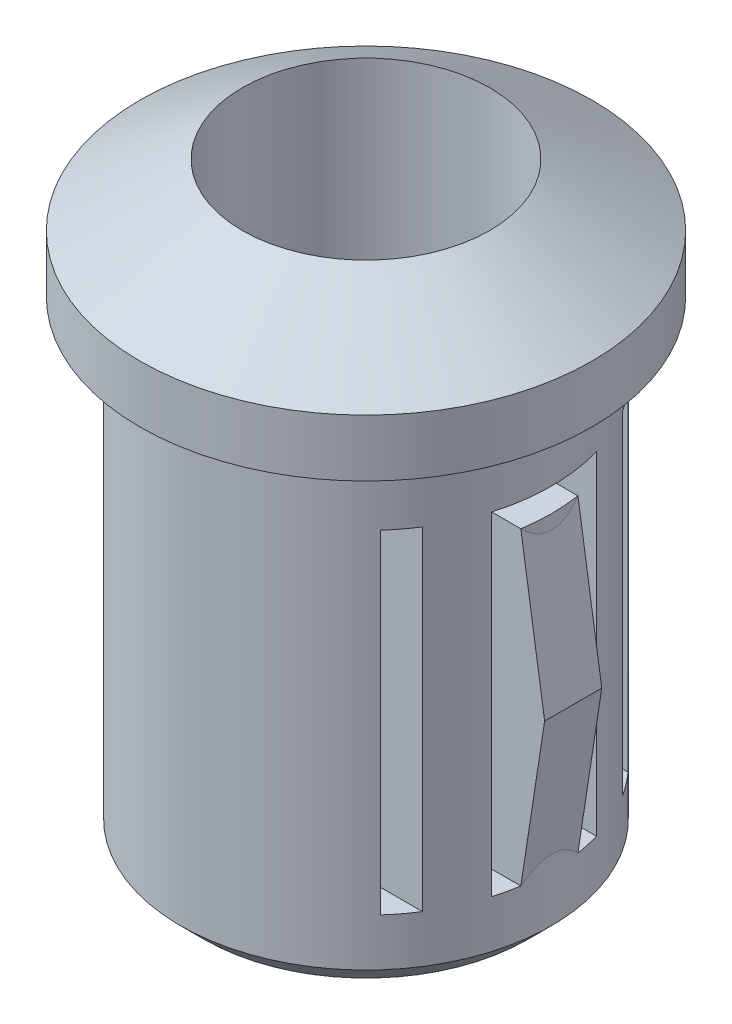
ISO-10303-21;
HEADER;
FILE_DESCRIPTION(('STEP AP214'),'2;1');
FILE_NAME('part.step','',(''),(''),'','','');
FILE_SCHEMA(('AUTOMOTIVE_DESIGN { 1 0 10303 214 1 1 1 1 }'));
ENDSEC;
DATA;
#1=APPLICATION_CONTEXT('core data for automotive mechanical design processes');
#2=APPLICATION_PROTOCOL_DEFINITION('international standard','automotive_design',2000,#1);
#3=PRODUCT_CONTEXT('',#1,'mechanical');
#4=PRODUCT('Part','Part','',(#3));
#5=PRODUCT_RELATED_PRODUCT_CATEGORY('part','',(#4));
#6=PRODUCT_DEFINITION_FORMATION('','',#4);
#7=PRODUCT_DEFINITION_CONTEXT('part definition',#1,'design');
#8=PRODUCT_DEFINITION('design','',#6,#7);
#9=PRODUCT_DEFINITION_SHAPE('','',#8);
#10=(LENGTH_UNIT() NAMED_UNIT(*) SI_UNIT(.MILLI.,.METRE.));
#11=(NAMED_UNIT(*) PLANE_ANGLE_UNIT() SI_UNIT($,.RADIAN.));
#12=(NAMED_UNIT(*) SI_UNIT($,.STERADIAN.) SOLID_ANGLE_UNIT());
#13=UNCERTAINTY_MEASURE_WITH_UNIT(LENGTH_MEASURE(1.E-05),#10,'distance_accuracy_value','');
#14=(GEOMETRIC_REPRESENTATION_CONTEXT(3) GLOBAL_UNCERTAINTY_ASSIGNED_CONTEXT((#13)) GLOBAL_UNIT_ASSIGNED_CONTEXT((#10,
#11,#12)) REPRESENTATION_CONTEXT('',''));
#15=CARTESIAN_POINT('',(0.,0.,0.));
#16=DIRECTION('',(0.,0.,1.));
#17=DIRECTION('',(1.,0.,0.));
#18=AXIS2_PLACEMENT_3D('',#15,#16,#17);
#19=CARTESIAN_POINT('',(0.,42.244045278096,0.));
#20=DIRECTION('',(0.,1.,0.));
#21=DIRECTION('',(-1.,0.,0.));
#22=AXIS2_PLACEMENT_3D('',#19,#20,#21);
#23=CYLINDRICAL_SURFACE('',#22,3.9);
#24=CARTESIAN_POINT('',(0.,24.548203528397,0.));
#25=DIRECTION('',(0.988371697650617,-0.152057184253941,0.));
#26=DIRECTION('',(0.152057184253941,0.988371697650617,0.));
#27=AXIS2_PLACEMENT_3D('',#24,#25,#26);
#28=ELLIPSE('',#27,25.6482455540335,3.9);
#29=CARTESIAN_POINT('',(-3.85356977359954,-0.5,0.6));
#30=VERTEX_POINT('',#29);
#31=CARTESIAN_POINT('',(-3.85356977359953,-0.5,-0.6));
#32=VERTEX_POINT('',#31);
#33=EDGE_CURVE('E279',#30,#32,#28,.T.);
#34=ORIENTED_EDGE('',*,*,#33,.F.);
#35=CARTESIAN_POINT('',(0.,-0.5,0.));
#36=DIRECTION('',(0.,-1.,0.));
#37=DIRECTION('',(0.,0.,-1.));
#38=AXIS2_PLACEMENT_3D('',#35,#36,#37);
#39=CIRCLE('',#38,3.9);
#40=EDGE_CURVE('E269',#30,#32,#39,.T.);
#41=ORIENTED_EDGE('',*,*,#40,.T.);
#42=EDGE_LOOP('',(#34,#41));
#43=FACE_BOUND('',#42,.T.);
#44=ADVANCED_FACE('F33',(#43),#23,.T.);
#45=CARTESIAN_POINT('',(0.,-7.99999999999999,0.));
#46=DIRECTION('',(0.,1.,0.));
#47=DIRECTION('',(-1.,0.,0.));
#48=AXIS2_PLACEMENT_3D('',#45,#46,#47);
#49=CIRCLE('',#48,3.9);
#50=CARTESIAN_POINT('',(-3.89999999999999,-7.99999999999999,0.));
#51=VERTEX_POINT('',#50);
#52=EDGE_CURVE('E41',#51,#51,#49,.T.);
#53=ORIENTED_EDGE('',*,*,#52,.T.);
#54=EDGE_LOOP('',(#53));
#55=FACE_BOUND('',#54,.T.);
#56=CARTESIAN_POINT('',(0.,1.5,0.));
#57=DIRECTION('',(0.,1.,0.));
#58=DIRECTION('',(-1.,0.,0.));
#59=AXIS2_PLACEMENT_3D('',#56,#57,#58);
#60=CIRCLE('',#59,3.9);
#61=CARTESIAN_POINT('',(-3.89999999999999,1.5,0.));
#62=VERTEX_POINT('',#61);
#63=EDGE_CURVE('E435',#62,#62,#60,.T.);
#64=ORIENTED_EDGE('',*,*,#63,.F.);
#65=EDGE_LOOP('',(#64));
#66=FACE_BOUND('',#65,.T.);
#67=CARTESIAN_POINT('',(0.,0.,0.));
#68=DIRECTION('',(0.,1.,0.));
#69=DIRECTION('',(0.,0.,1.));
#70=AXIS2_PLACEMENT_3D('',#67,#68,#69);
#71=CIRCLE('',#70,3.9);
#72=CARTESIAN_POINT('',(-3.28633534503098,0.,2.1));
#73=VERTEX_POINT('',#72);
#74=CARTESIAN_POINT('',(-2.90688837074972,0.,2.6));
#75=VERTEX_POINT('',#74);
#76=EDGE_CURVE('E416',#73,#75,#71,.T.);
#77=ORIENTED_EDGE('',*,*,#76,.T.);
#78=DIRECTION('',(0.,1.,0.));
#79=VECTOR('',#78,1.);
#80=CARTESIAN_POINT('',(-2.90688837074972,42.244045278096,2.6));
#81=LINE('',#80,#79);
#82=CARTESIAN_POINT('',(-2.90688837074972,-7.,2.6));
#83=VERTEX_POINT('',#82);
#84=EDGE_CURVE('E420',#75,#83,#81,.F.);
#85=ORIENTED_EDGE('',*,*,#84,.T.);
#86=CARTESIAN_POINT('',(0.,-7.,0.));
#87=DIRECTION('',(0.,-1.,0.));
#88=DIRECTION('',(0.,0.,-1.));
#89=AXIS2_PLACEMENT_3D('',#86,#87,#88);
#90=CIRCLE('',#89,3.9);
#91=CARTESIAN_POINT('',(-3.28633534503099,-7.,2.1));
#92=VERTEX_POINT('',#91);
#93=EDGE_CURVE('E406',#83,#92,#90,.T.);
#94=ORIENTED_EDGE('',*,*,#93,.T.);
#95=DIRECTION('',(0.,1.,0.));
#96=VECTOR('',#95,1.);
#97=CARTESIAN_POINT('',(-3.28633534503099,42.244045278096,2.10000000000001));
#98=LINE('',#97,#96);
#99=EDGE_CURVE('E413',#92,#73,#98,.T.);
#100=ORIENTED_EDGE('',*,*,#99,.T.);
#101=EDGE_LOOP('',(#77,#85,#94,#100));
#102=FACE_BOUND('',#101,.T.);
#103=CARTESIAN_POINT('',(3.286335345031,-7.,2.1));
#104=VERTEX_POINT('',#103);
#105=CARTESIAN_POINT('',(2.90688837074973,-7.,2.6));
#106=VERTEX_POINT('',#105);
#107=EDGE_CURVE('E409',#104,#106,#90,.T.);
#108=ORIENTED_EDGE('',*,*,#107,.T.);
#109=DIRECTION('',(0.,1.,0.));
#110=VECTOR('',#109,1.);
#111=CARTESIAN_POINT('',(2.90688837074972,42.244045278096,2.6));
#112=LINE('',#111,#110);
#113=CARTESIAN_POINT('',(2.90688837074973,0.,2.6));
#114=VERTEX_POINT('',#113);
#115=EDGE_CURVE('E423',#106,#114,#112,.T.);
#116=ORIENTED_EDGE('',*,*,#115,.T.);
#117=CARTESIAN_POINT('',(3.28633534503099,0.,2.1));
#118=VERTEX_POINT('',#117);
#119=EDGE_CURVE('E419',#114,#118,#71,.T.);
#120=ORIENTED_EDGE('',*,*,#119,.T.);
#121=DIRECTION('',(0.,1.,0.));
#122=VECTOR('',#121,1.);
#123=CARTESIAN_POINT('',(3.28633534503099,42.244045278096,2.10000000000001));
#124=LINE('',#123,#122);
#125=EDGE_CURVE('E410',#118,#104,#124,.F.);
#126=ORIENTED_EDGE('',*,*,#125,.T.);
#127=EDGE_LOOP('',(#108,#116,#120,#126));
#128=FACE_BOUND('',#127,.T.);
#129=CARTESIAN_POINT('',(0.,0.,0.));
#130=DIRECTION('',(0.,1.,0.));
#131=DIRECTION('',(0.,0.,1.));
#132=AXIS2_PLACEMENT_3D('',#129,#130,#131);
#133=CIRCLE('',#132,3.9);
#134=CARTESIAN_POINT('',(-2.90688837074974,0.,-2.6));
#135=VERTEX_POINT('',#134);
#136=CARTESIAN_POINT('',(-3.28633534503099,0.,-2.1));
#137=VERTEX_POINT('',#136);
#138=EDGE_CURVE('E381',#135,#137,#133,.T.);
#139=ORIENTED_EDGE('',*,*,#138,.T.);
#140=DIRECTION('',(0.,1.,0.));
#141=VECTOR('',#140,1.);
#142=CARTESIAN_POINT('',(-3.28633534503101,42.244045278096,-2.09999999999998));
#143=LINE('',#142,#141);
#144=CARTESIAN_POINT('',(-3.28633534503099,-7.,-2.1));
#145=VERTEX_POINT('',#144);
#146=EDGE_CURVE('E385',#137,#145,#143,.F.);
#147=ORIENTED_EDGE('',*,*,#146,.T.);
#148=CARTESIAN_POINT('',(0.,-7.,0.));
#149=DIRECTION('',(0.,-1.,0.));
#150=DIRECTION('',(0.,0.,-1.));
#151=AXIS2_PLACEMENT_3D('',#148,#149,#150);
#152=CIRCLE('',#151,3.9);
#153=CARTESIAN_POINT('',(-2.90688837074971,-7.,-2.6));
#154=VERTEX_POINT('',#153);
#155=EDGE_CURVE('E371',#145,#154,#152,.T.);
#156=ORIENTED_EDGE('',*,*,#155,.T.);
#157=DIRECTION('',(0.,1.,0.));
#158=VECTOR('',#157,1.);
#159=CARTESIAN_POINT('',(-2.90688837074974,42.244045278096,-2.59999999999998));
#160=LINE('',#159,#158);
#161=EDGE_CURVE('E378',#154,#135,#160,.T.);
#162=ORIENTED_EDGE('',*,*,#161,.T.);
#163=EDGE_LOOP('',(#139,#147,#156,#162));
#164=FACE_BOUND('',#163,.T.);
#165=CARTESIAN_POINT('',(2.90688837074973,-7.,-2.6));
#166=VERTEX_POINT('',#165);
#167=CARTESIAN_POINT('',(3.286335345031,-7.,-2.1));
#168=VERTEX_POINT('',#167);
#169=EDGE_CURVE('E374',#166,#168,#152,.T.);
#170=ORIENTED_EDGE('',*,*,#169,.T.);
#171=DIRECTION('',(0.,1.,0.));
#172=VECTOR('',#171,1.);
#173=CARTESIAN_POINT('',(3.28633534503101,42.244045278096,-2.09999999999998));
#174=LINE('',#173,#172);
#175=CARTESIAN_POINT('',(3.286335345031,0.,-2.1));
#176=VERTEX_POINT('',#175);
#177=EDGE_CURVE('E388',#168,#176,#174,.T.);
#178=ORIENTED_EDGE('',*,*,#177,.T.);
#179=CARTESIAN_POINT('',(2.90688837074975,0.,-2.6));
#180=VERTEX_POINT('',#179);
#181=EDGE_CURVE('E384',#176,#180,#133,.T.);
#182=ORIENTED_EDGE('',*,*,#181,.T.);
#183=DIRECTION('',(0.,1.,0.));
#184=VECTOR('',#183,1.);
#185=CARTESIAN_POINT('',(2.90688837074974,42.244045278096,-2.59999999999998));
#186=LINE('',#185,#184);
#187=EDGE_CURVE('E375',#180,#166,#186,.F.);
#188=ORIENTED_EDGE('',*,*,#187,.T.);
#189=EDGE_LOOP('',(#170,#178,#182,#188));
#190=FACE_BOUND('',#189,.T.);
#191=CARTESIAN_POINT('',(0.,-7.,0.));
#192=DIRECTION('',(0.,-1.,0.));
#193=DIRECTION('',(0.,0.,-1.));
#194=AXIS2_PLACEMENT_3D('',#191,#192,#193);
#195=CIRCLE('',#194,3.9);
#196=CARTESIAN_POINT('',(3.74165738677395,-7.,-1.1));
#197=VERTEX_POINT('',#196);
#198=CARTESIAN_POINT('',(3.85356977359954,-7.,-0.6));
#199=VERTEX_POINT('',#198);
#200=EDGE_CURVE('E339',#197,#199,#195,.T.);
#201=ORIENTED_EDGE('',*,*,#200,.T.);
#202=CARTESIAN_POINT('',(0.,-32.0482035283972,0.));
#203=DIRECTION('',(0.988371697650617,-0.15205718425394,0.));
#204=DIRECTION('',(0.15205718425394,0.988371697650617,0.));
#205=AXIS2_PLACEMENT_3D('',#202,#203,#204);
#206=ELLIPSE('',#205,25.6482455540337,3.9);
#207=CARTESIAN_POINT('',(3.85356977359954,-7.,0.6));
#208=VERTEX_POINT('',#207);
#209=EDGE_CURVE('E516',#199,#208,#206,.T.);
#210=ORIENTED_EDGE('',*,*,#209,.T.);
#211=CARTESIAN_POINT('',(0.,-7.,0.));
#212=DIRECTION('',(0.,-1.,0.));
#213=DIRECTION('',(0.,0.,-1.));
#214=AXIS2_PLACEMENT_3D('',#211,#212,#213);
#215=CIRCLE('',#214,3.9);
#216=CARTESIAN_POINT('',(3.74165738677395,-7.,1.1));
#217=VERTEX_POINT('',#216);
#218=EDGE_CURVE('E277',#208,#217,#215,.T.);
#219=ORIENTED_EDGE('',*,*,#218,.T.);
#220=DIRECTION('',(0.,1.,0.));
#221=VECTOR('',#220,1.);
#222=CARTESIAN_POINT('',(3.74165738677394,42.244045278096,1.1));
#223=LINE('',#222,#221);
#224=CARTESIAN_POINT('',(3.74165738677395,0.,1.1));
#225=VERTEX_POINT('',#224);
#226=EDGE_CURVE('E353',#217,#225,#223,.T.);
#227=ORIENTED_EDGE('',*,*,#226,.T.);
#228=CARTESIAN_POINT('',(0.,0.,0.));
#229=DIRECTION('',(0.,1.,0.));
#230=DIRECTION('',(0.,0.,1.));
#231=AXIS2_PLACEMENT_3D('',#228,#229,#230);
#232=CIRCLE('',#231,3.9);
#233=CARTESIAN_POINT('',(3.74165738677394,0.,-1.1));
#234=VERTEX_POINT('',#233);
#235=EDGE_CURVE('E349',#225,#234,#232,.T.);
#236=ORIENTED_EDGE('',*,*,#235,.T.);
#237=DIRECTION('',(0.,1.,0.));
#238=VECTOR('',#237,1.);
#239=CARTESIAN_POINT('',(3.74165738677394,42.244045278096,-1.1));
#240=LINE('',#239,#238);
#241=EDGE_CURVE('E340',#234,#197,#240,.F.);
#242=ORIENTED_EDGE('',*,*,#241,.T.);
#243=EDGE_LOOP('',(#201,#210,#219,#227,#236,#242));
#244=FACE_BOUND('',#243,.T.);
#245=CARTESIAN_POINT('',(0.,-32.0482035283973,0.));
#246=DIRECTION('',(0.988371697650617,0.15205718425394,0.));
#247=DIRECTION('',(-0.15205718425394,0.988371697650617,0.));
#248=AXIS2_PLACEMENT_3D('',#245,#246,#247);
#249=ELLIPSE('',#248,25.6482455540337,3.9);
#250=CARTESIAN_POINT('',(-3.85356977359953,-7.,-0.6));
#251=VERTEX_POINT('',#250);
#252=CARTESIAN_POINT('',(-3.85356977359953,-7.,0.6));
#253=VERTEX_POINT('',#252);
#254=EDGE_CURVE('E518',#251,#253,#249,.T.);
#255=ORIENTED_EDGE('',*,*,#254,.F.);
#256=CARTESIAN_POINT('',(-3.74165738677393,-7.,-1.1));
#257=VERTEX_POINT('',#256);
#258=EDGE_CURVE('E336',#251,#257,#195,.T.);
#259=ORIENTED_EDGE('',*,*,#258,.T.);
#260=DIRECTION('',(0.,1.,0.));
#261=VECTOR('',#260,1.);
#262=CARTESIAN_POINT('',(-3.74165738677394,42.244045278096,-1.1));
#263=LINE('',#262,#261);
#264=CARTESIAN_POINT('',(-3.74165738677393,0.,-1.1));
#265=VERTEX_POINT('',#264);
#266=EDGE_CURVE('E343',#257,#265,#263,.T.);
#267=ORIENTED_EDGE('',*,*,#266,.T.);
#268=CARTESIAN_POINT('',(-3.74165738677393,0.,1.1));
#269=VERTEX_POINT('',#268);
#270=EDGE_CURVE('E346',#265,#269,#232,.T.);
#271=ORIENTED_EDGE('',*,*,#270,.T.);
#272=DIRECTION('',(0.,1.,0.));
#273=VECTOR('',#272,1.);
#274=CARTESIAN_POINT('',(-3.74165738677394,42.244045278096,1.1));
#275=LINE('',#274,#273);
#276=CARTESIAN_POINT('',(-3.74165738677393,-7.,1.1));
#277=VERTEX_POINT('',#276);
#278=EDGE_CURVE('E350',#269,#277,#275,.F.);
#279=ORIENTED_EDGE('',*,*,#278,.T.);
#280=EDGE_CURVE('E334',#277,#253,#215,.T.);
#281=ORIENTED_EDGE('',*,*,#280,.T.);
#282=EDGE_LOOP('',(#255,#259,#267,#271,#279,#281));
#283=FACE_BOUND('',#282,.T.);
#284=ADVANCED_FACE('F523',(#55,#66,#102,#128,#164,#190,#244,#283),#23,.T.);
#285=CARTESIAN_POINT('',(3.85356977359954,-0.5,-0.6));
#286=VERTEX_POINT('',#285);
#287=CARTESIAN_POINT('',(3.85356977359954,-0.5,0.6));
#288=VERTEX_POINT('',#287);
#289=EDGE_CURVE('E276',#286,#288,#39,.T.);
#290=ORIENTED_EDGE('',*,*,#289,.T.);
#291=CARTESIAN_POINT('',(0.,24.548203528397,0.));
#292=DIRECTION('',(0.988371697650617,0.152057184253941,0.));
#293=DIRECTION('',(-0.152057184253941,0.988371697650617,0.));
#294=AXIS2_PLACEMENT_3D('',#291,#292,#293);
#295=ELLIPSE('',#294,25.6482455540336,3.9);
#296=EDGE_CURVE('E310',#288,#286,#295,.T.);
#297=ORIENTED_EDGE('',*,*,#296,.T.);
#298=EDGE_LOOP('',(#290,#297));
#299=FACE_BOUND('',#298,.T.);
#300=ADVANCED_FACE('F536',(#299),#23,.T.);
#301=CARTESIAN_POINT('',(3.10000000000001,0.,0.));
#302=DIRECTION('',(0.,1.,0.));
#303=DIRECTION('',(-1.,0.,0.));
#304=AXIS2_PLACEMENT_3D('',#301,#302,#303);
#305=PLANE('',#304);
#306=CARTESIAN_POINT('',(0.,0.,0.));
#307=DIRECTION('',(0.,1.,0.));
#308=DIRECTION('',(-1.,0.,0.));
#309=AXIS2_PLACEMENT_3D('',#306,#307,#308);
#310=CIRCLE('',#309,2.6);
#311=CARTESIAN_POINT('',(-2.59999999999999,0.,0.));
#312=VERTEX_POINT('',#311);
#313=EDGE_CURVE('E447',#312,#312,#310,.T.);
#314=ORIENTED_EDGE('',*,*,#313,.T.);
#315=EDGE_LOOP('',(#314));
#316=FACE_BOUND('',#315,.T.);
#317=CARTESIAN_POINT('',(0.,0.,0.));
#318=DIRECTION('',(0.,1.,0.));
#319=DIRECTION('',(-1.,0.,0.));
#320=AXIS2_PLACEMENT_3D('',#317,#318,#319);
#321=CIRCLE('',#320,3.1);
#322=CARTESIAN_POINT('',(2.89827534923789,0.,-1.1));
#323=VERTEX_POINT('',#322);
#324=CARTESIAN_POINT('',(2.28035085019828,0.,-2.1));
#325=VERTEX_POINT('',#324);
#326=EDGE_CURVE('E431',#323,#325,#321,.T.);
#327=ORIENTED_EDGE('',*,*,#326,.F.);
#328=DIRECTION('',(1.,0.,0.));
#329=VECTOR('',#328,1.);
#330=CARTESIAN_POINT('',(-4.74999999999999,0.,-1.1));
#331=LINE('',#330,#329);
#332=EDGE_CURVE('E318',#323,#234,#331,.T.);
#333=ORIENTED_EDGE('',*,*,#332,.T.);
#334=ORIENTED_EDGE('',*,*,#235,.F.);
#335=DIRECTION('',(1.,0.,0.));
#336=VECTOR('',#335,1.);
#337=CARTESIAN_POINT('',(-4.74999999999999,0.,1.1));
#338=LINE('',#337,#336);
#339=CARTESIAN_POINT('',(2.89827534923789,0.,1.1));
#340=VERTEX_POINT('',#339);
#341=EDGE_CURVE('E313',#340,#225,#338,.T.);
#342=ORIENTED_EDGE('',*,*,#341,.F.);
#343=CARTESIAN_POINT('',(2.28035085019827,0.,2.1));
#344=VERTEX_POINT('',#343);
#345=EDGE_CURVE('E427',#344,#340,#321,.T.);
#346=ORIENTED_EDGE('',*,*,#345,.F.);
#347=DIRECTION('',(1.,0.,0.));
#348=VECTOR('',#347,1.);
#349=CARTESIAN_POINT('',(-4.74999999999999,0.,2.1));
#350=LINE('',#349,#348);
#351=EDGE_CURVE('E397',#344,#118,#350,.T.);
#352=ORIENTED_EDGE('',*,*,#351,.T.);
#353=ORIENTED_EDGE('',*,*,#119,.F.);
#354=DIRECTION('',(1.,0.,0.));
#355=VECTOR('',#354,1.);
#356=CARTESIAN_POINT('',(-4.74999999999999,0.,2.6));
#357=LINE('',#356,#355);
#358=CARTESIAN_POINT('',(1.68819430161342,0.,2.6));
#359=VERTEX_POINT('',#358);
#360=EDGE_CURVE('E392',#359,#114,#357,.T.);
#361=ORIENTED_EDGE('',*,*,#360,.F.);
#362=CARTESIAN_POINT('',(-1.6881943016134,0.,2.6));
#363=VERTEX_POINT('',#362);
#364=EDGE_CURVE('E430',#363,#359,#321,.T.);
#365=ORIENTED_EDGE('',*,*,#364,.F.);
#366=EDGE_CURVE('E395',#75,#363,#357,.T.);
#367=ORIENTED_EDGE('',*,*,#366,.F.);
#368=ORIENTED_EDGE('',*,*,#76,.F.);
#369=CARTESIAN_POINT('',(-2.28035085019826,0.,2.1));
#370=VERTEX_POINT('',#369);
#371=EDGE_CURVE('E396',#73,#370,#350,.T.);
#372=ORIENTED_EDGE('',*,*,#371,.T.);
#373=CARTESIAN_POINT('',(-2.89827534923788,0.,1.1));
#374=VERTEX_POINT('',#373);
#375=EDGE_CURVE('E426',#374,#370,#321,.T.);
#376=ORIENTED_EDGE('',*,*,#375,.F.);
#377=EDGE_CURVE('E316',#269,#374,#338,.T.);
#378=ORIENTED_EDGE('',*,*,#377,.F.);
#379=ORIENTED_EDGE('',*,*,#270,.F.);
#380=CARTESIAN_POINT('',(-2.89827534923788,0.,-1.1));
#381=VERTEX_POINT('',#380);
#382=EDGE_CURVE('E317',#265,#381,#331,.T.);
#383=ORIENTED_EDGE('',*,*,#382,.T.);
#384=CARTESIAN_POINT('',(-2.28035085019827,0.,-2.1));
#385=VERTEX_POINT('',#384);
#386=EDGE_CURVE('E597',#385,#381,#321,.T.);
#387=ORIENTED_EDGE('',*,*,#386,.F.);
#388=DIRECTION('',(1.,0.,0.));
#389=VECTOR('',#388,1.);
#390=CARTESIAN_POINT('',(-4.74999999999999,0.,-2.1));
#391=LINE('',#390,#389);
#392=EDGE_CURVE('E360',#137,#385,#391,.T.);
#393=ORIENTED_EDGE('',*,*,#392,.F.);
#394=ORIENTED_EDGE('',*,*,#138,.F.);
#395=DIRECTION('',(1.,0.,0.));
#396=VECTOR('',#395,1.);
#397=CARTESIAN_POINT('',(-4.74999999999999,0.,-2.6));
#398=LINE('',#397,#396);
#399=CARTESIAN_POINT('',(-1.68819430161344,0.,-2.6));
#400=VERTEX_POINT('',#399);
#401=EDGE_CURVE('E361',#135,#400,#398,.T.);
#402=ORIENTED_EDGE('',*,*,#401,.T.);
#403=CARTESIAN_POINT('',(1.68819430161345,0.,-2.6));
#404=VERTEX_POINT('',#403);
#405=EDGE_CURVE('E595',#404,#400,#321,.T.);
#406=ORIENTED_EDGE('',*,*,#405,.F.);
#407=EDGE_CURVE('E362',#404,#180,#398,.T.);
#408=ORIENTED_EDGE('',*,*,#407,.T.);
#409=ORIENTED_EDGE('',*,*,#181,.F.);
#410=EDGE_CURVE('E357',#325,#176,#391,.T.);
#411=ORIENTED_EDGE('',*,*,#410,.F.);
#412=EDGE_LOOP('',(#327,#333,#334,#342,#346,#352,#353,#361,#365,#367,#368,#372,#376,#378,#379,
#383,#387,#393,#394,#402,#406,#408,#409,#411));
#413=FACE_BOUND('',#412,.T.);
#414=ADVANCED_FACE('F543',(#316,#413),#305,.F.);
#415=CARTESIAN_POINT('',(0.,42.244045278096,0.));
#416=DIRECTION('',(0.,1.,0.));
#417=DIRECTION('',(-1.,0.,0.));
#418=AXIS2_PLACEMENT_3D('',#415,#416,#417);
#419=CYLINDRICAL_SURFACE('',#418,2.6);
#420=ORIENTED_EDGE('',*,*,#313,.F.);
#421=EDGE_LOOP('',(#420));
#422=FACE_BOUND('',#421,.T.);
#423=CARTESIAN_POINT('',(0.,4.,0.));
#424=DIRECTION('',(0.,1.,0.));
#425=DIRECTION('',(-1.,0.,0.));
#426=AXIS2_PLACEMENT_3D('',#423,#424,#425);
#427=CIRCLE('',#426,2.6);
#428=CARTESIAN_POINT('',(-2.59999999999999,4.,0.));
#429=VERTEX_POINT('',#428);
#430=EDGE_CURVE('E444',#429,#429,#427,.T.);
#431=ORIENTED_EDGE('',*,*,#430,.T.);
#432=EDGE_LOOP('',(#431));
#433=FACE_BOUND('',#432,.T.);
#434=ADVANCED_FACE('F548',(#422,#433),#419,.F.);
#435=CARTESIAN_POINT('',(0.,2.7,0.));
#436=DIRECTION('',(0.,-1.,0.));
#437=DIRECTION('',(1.,0.,0.));
#438=AXIS2_PLACEMENT_3D('',#435,#436,#437);
#439=CONICAL_SURFACE('',#438,4.75,1.02696387049278);
#440=ORIENTED_EDGE('',*,*,#430,.F.);
#441=EDGE_LOOP('',(#440));
#442=FACE_BOUND('',#441,.T.);
#443=CARTESIAN_POINT('',(0.,2.7,0.));
#444=DIRECTION('',(0.,1.,0.));
#445=DIRECTION('',(-1.,0.,0.));
#446=AXIS2_PLACEMENT_3D('',#443,#444,#445);
#447=CIRCLE('',#446,4.75);
#448=CARTESIAN_POINT('',(-4.74999999999999,2.7,0.));
#449=VERTEX_POINT('',#448);
#450=EDGE_CURVE('E441',#449,#449,#447,.T.);
#451=ORIENTED_EDGE('',*,*,#450,.T.);
#452=EDGE_LOOP('',(#451));
#453=FACE_BOUND('',#452,.T.);
#454=ADVANCED_FACE('F692',(#442,#453),#439,.T.);
#455=CARTESIAN_POINT('',(0.,42.244045278096,0.));
#456=DIRECTION('',(0.,1.,0.));
#457=DIRECTION('',(-1.,0.,0.));
#458=AXIS2_PLACEMENT_3D('',#455,#456,#457);
#459=CYLINDRICAL_SURFACE('',#458,4.75);
#460=ORIENTED_EDGE('',*,*,#450,.F.);
#461=EDGE_LOOP('',(#460));
#462=FACE_BOUND('',#461,.T.);
#463=CARTESIAN_POINT('',(0.,1.5,0.));
#464=DIRECTION('',(0.,1.,0.));
#465=DIRECTION('',(-1.,0.,0.));
#466=AXIS2_PLACEMENT_3D('',#463,#464,#465);
#467=CIRCLE('',#466,4.75);
#468=CARTESIAN_POINT('',(-4.74999999999999,1.5,0.));
#469=VERTEX_POINT('',#468);
#470=EDGE_CURVE('E438',#469,#469,#467,.T.);
#471=ORIENTED_EDGE('',*,*,#470,.T.);
#472=EDGE_LOOP('',(#471));
#473=FACE_BOUND('',#472,.T.);
#474=ADVANCED_FACE('F685',(#462,#473),#459,.T.);
#475=CARTESIAN_POINT('',(4.75000000000001,1.5,0.));
#476=DIRECTION('',(0.,1.,0.));
#477=DIRECTION('',(-1.,0.,0.));
#478=AXIS2_PLACEMENT_3D('',#475,#476,#477);
#479=PLANE('',#478);
#480=ORIENTED_EDGE('',*,*,#470,.F.);
#481=EDGE_LOOP('',(#480));
#482=FACE_BOUND('',#481,.T.);
#483=ORIENTED_EDGE('',*,*,#63,.T.);
#484=EDGE_LOOP('',(#483));
#485=FACE_BOUND('',#484,.T.);
#486=ADVANCED_FACE('F680',(#482,#485),#479,.F.);
#487=CARTESIAN_POINT('',(3.90000000000001,-8.5,0.));
#488=DIRECTION('',(0.,1.,0.));
#489=DIRECTION('',(-1.,0.,0.));
#490=AXIS2_PLACEMENT_3D('',#487,#488,#489);
#491=PLANE('',#490);
#492=CARTESIAN_POINT('',(0.,-8.5,0.));
#493=DIRECTION('',(0.,1.,0.));
#494=DIRECTION('',(-1.,0.,0.));
#495=AXIS2_PLACEMENT_3D('',#492,#493,#494);
#496=CIRCLE('',#495,3.39999999999999);
#497=CARTESIAN_POINT('',(-3.39999999999999,-8.5,0.));
#498=VERTEX_POINT('',#497);
#499=EDGE_CURVE('E11',#498,#498,#496,.F.);
#500=ORIENTED_EDGE('',*,*,#499,.T.);
#501=EDGE_LOOP('',(#500));
#502=FACE_BOUND('',#501,.T.);
#503=CARTESIAN_POINT('',(0.,-8.5,0.));
#504=DIRECTION('',(0.,1.,0.));
#505=DIRECTION('',(-1.,0.,0.));
#506=AXIS2_PLACEMENT_3D('',#503,#504,#505);
#507=CIRCLE('',#506,3.1);
#508=CARTESIAN_POINT('',(-3.09999999999999,-8.5,0.));
#509=VERTEX_POINT('',#508);
#510=EDGE_CURVE('E432',#509,#509,#507,.T.);
#511=ORIENTED_EDGE('',*,*,#510,.T.);
#512=EDGE_LOOP('',(#511));
#513=FACE_BOUND('',#512,.T.);
#514=ADVANCED_FACE('F678',(#502,#513),#491,.F.);
#515=CARTESIAN_POINT('',(0.,42.244045278096,0.));
#516=DIRECTION('',(0.,1.,0.));
#517=DIRECTION('',(-1.,0.,0.));
#518=AXIS2_PLACEMENT_3D('',#515,#516,#517);
#519=CYLINDRICAL_SURFACE('',#518,3.1);
#520=CARTESIAN_POINT('',(0.,-7.,0.));
#521=DIRECTION('',(0.,-1.,0.));
#522=DIRECTION('',(0.,0.,-1.));
#523=AXIS2_PLACEMENT_3D('',#520,#521,#522);
#524=CIRCLE('',#523,3.1);
#525=CARTESIAN_POINT('',(-3.0413812651491,-7.,0.6));
#526=VERTEX_POINT('',#525);
#527=CARTESIAN_POINT('',(-2.89827534923788,-7.,1.1));
#528=VERTEX_POINT('',#527);
#529=EDGE_CURVE('E486',#526,#528,#524,.F.);
#530=ORIENTED_EDGE('',*,*,#529,.T.);
#531=DIRECTION('',(0.,1.,0.));
#532=VECTOR('',#531,1.);
#533=CARTESIAN_POINT('',(-2.89827534923789,42.244045278096,1.1));
#534=LINE('',#533,#532);
#535=EDGE_CURVE('E513',#528,#374,#534,.T.);
#536=ORIENTED_EDGE('',*,*,#535,.T.);
#537=ORIENTED_EDGE('',*,*,#375,.T.);
#538=DIRECTION('',(0.,1.,0.));
#539=VECTOR('',#538,1.);
#540=CARTESIAN_POINT('',(-2.28035085019827,42.244045278096,2.10000000000001));
#541=LINE('',#540,#539);
#542=CARTESIAN_POINT('',(-2.28035085019827,-7.,2.1));
#543=VERTEX_POINT('',#542);
#544=EDGE_CURVE('E460',#370,#543,#541,.F.);
#545=ORIENTED_EDGE('',*,*,#544,.T.);
#546=CARTESIAN_POINT('',(0.,-7.,0.));
#547=DIRECTION('',(0.,-1.,0.));
#548=DIRECTION('',(0.,0.,-1.));
#549=AXIS2_PLACEMENT_3D('',#546,#547,#548);
#550=CIRCLE('',#549,3.1);
#551=CARTESIAN_POINT('',(-1.6881943016134,-7.,2.6));
#552=VERTEX_POINT('',#551);
#553=EDGE_CURVE('E454',#543,#552,#550,.F.);
#554=ORIENTED_EDGE('',*,*,#553,.T.);
#555=DIRECTION('',(0.,1.,0.));
#556=VECTOR('',#555,1.);
#557=CARTESIAN_POINT('',(-1.68819430161341,42.244045278096,2.6));
#558=LINE('',#557,#556);
#559=EDGE_CURVE('E463',#552,#363,#558,.T.);
#560=ORIENTED_EDGE('',*,*,#559,.T.);
#561=ORIENTED_EDGE('',*,*,#364,.T.);
#562=DIRECTION('',(0.,1.,0.));
#563=VECTOR('',#562,1.);
#564=CARTESIAN_POINT('',(1.68819430161341,42.244045278096,2.6));
#565=LINE('',#564,#563);
#566=CARTESIAN_POINT('',(1.68819430161342,-7.,2.6));
#567=VERTEX_POINT('',#566);
#568=EDGE_CURVE('E457',#359,#567,#565,.F.);
#569=ORIENTED_EDGE('',*,*,#568,.T.);
#570=CARTESIAN_POINT('',(2.28035085019828,-7.,2.1));
#571=VERTEX_POINT('',#570);
#572=EDGE_CURVE('E450',#567,#571,#550,.F.);
#573=ORIENTED_EDGE('',*,*,#572,.T.);
#574=DIRECTION('',(0.,1.,0.));
#575=VECTOR('',#574,1.);
#576=CARTESIAN_POINT('',(2.28035085019827,42.244045278096,2.10000000000001));
#577=LINE('',#576,#575);
#578=EDGE_CURVE('E453',#571,#344,#577,.T.);
#579=ORIENTED_EDGE('',*,*,#578,.T.);
#580=ORIENTED_EDGE('',*,*,#345,.T.);
#581=DIRECTION('',(0.,1.,0.));
#582=VECTOR('',#581,1.);
#583=CARTESIAN_POINT('',(2.89827534923789,42.244045278096,1.1));
#584=LINE('',#583,#582);
#585=CARTESIAN_POINT('',(2.89827534923789,-7.,1.1));
#586=VERTEX_POINT('',#585);
#587=EDGE_CURVE('E503',#340,#586,#584,.F.);
#588=ORIENTED_EDGE('',*,*,#587,.T.);
#589=CARTESIAN_POINT('',(3.04138126514912,-7.,0.6));
#590=VERTEX_POINT('',#589);
#591=EDGE_CURVE('E482',#586,#590,#524,.F.);
#592=ORIENTED_EDGE('',*,*,#591,.T.);
#593=DIRECTION('',(0.,1.,0.));
#594=VECTOR('',#593,1.);
#595=CARTESIAN_POINT('',(3.04138126514911,42.244045278096,0.599999999999999));
#596=LINE('',#595,#594);
#597=CARTESIAN_POINT('',(3.04138126514911,-0.5,0.6));
#598=VERTEX_POINT('',#597);
#599=EDGE_CURVE('E485',#590,#598,#596,.T.);
#600=ORIENTED_EDGE('',*,*,#599,.T.);
#601=CARTESIAN_POINT('',(0.,-0.5,0.));
#602=DIRECTION('',(0.,-1.,0.));
#603=DIRECTION('',(0.,0.,-1.));
#604=AXIS2_PLACEMENT_3D('',#601,#602,#603);
#605=CIRCLE('',#604,3.1);
#606=CARTESIAN_POINT('',(3.04138126514911,-0.5,-0.6));
#607=VERTEX_POINT('',#606);
#608=EDGE_CURVE('E489',#598,#607,#605,.F.);
#609=ORIENTED_EDGE('',*,*,#608,.T.);
#610=DIRECTION('',(0.,1.,0.));
#611=VECTOR('',#610,1.);
#612=CARTESIAN_POINT('',(3.04138126514911,42.244045278096,-0.599999999999999));
#613=LINE('',#612,#611);
#614=CARTESIAN_POINT('',(3.04138126514911,-7.,-0.6));
#615=VERTEX_POINT('',#614);
#616=EDGE_CURVE('E492',#607,#615,#613,.F.);
#617=ORIENTED_EDGE('',*,*,#616,.T.);
#618=CARTESIAN_POINT('',(0.,-7.,0.));
#619=DIRECTION('',(0.,-1.,0.));
#620=DIRECTION('',(0.,0.,-1.));
#621=AXIS2_PLACEMENT_3D('',#618,#619,#620);
#622=CIRCLE('',#621,3.1);
#623=CARTESIAN_POINT('',(2.89827534923789,-7.,-1.1));
#624=VERTEX_POINT('',#623);
#625=EDGE_CURVE('E496',#615,#624,#622,.F.);
#626=ORIENTED_EDGE('',*,*,#625,.T.);
#627=DIRECTION('',(0.,1.,0.));
#628=VECTOR('',#627,1.);
#629=CARTESIAN_POINT('',(2.89827534923789,42.244045278096,-1.1));
#630=LINE('',#629,#628);
#631=EDGE_CURVE('E499',#624,#323,#630,.T.);
#632=ORIENTED_EDGE('',*,*,#631,.T.);
#633=ORIENTED_EDGE('',*,*,#326,.T.);
#634=DIRECTION('',(0.,1.,0.));
#635=VECTOR('',#634,1.);
#636=CARTESIAN_POINT('',(2.2803508501983,42.244045278096,-2.09999999999998));
#637=LINE('',#636,#635);
#638=CARTESIAN_POINT('',(2.28035085019828,-7.,-2.1));
#639=VERTEX_POINT('',#638);
#640=EDGE_CURVE('E473',#325,#639,#637,.F.);
#641=ORIENTED_EDGE('',*,*,#640,.T.);
#642=CARTESIAN_POINT('',(0.,-7.,0.));
#643=DIRECTION('',(0.,-1.,0.));
#644=DIRECTION('',(0.,0.,-1.));
#645=AXIS2_PLACEMENT_3D('',#642,#643,#644);
#646=CIRCLE('',#645,3.1);
#647=CARTESIAN_POINT('',(1.68819430161341,-7.,-2.6));
#648=VERTEX_POINT('',#647);
#649=EDGE_CURVE('E466',#639,#648,#646,.F.);
#650=ORIENTED_EDGE('',*,*,#649,.T.);
#651=DIRECTION('',(0.,1.,0.));
#652=VECTOR('',#651,1.);
#653=CARTESIAN_POINT('',(1.68819430161345,42.244045278096,-2.59999999999998));
#654=LINE('',#653,#652);
#655=EDGE_CURVE('E469',#648,#404,#654,.T.);
#656=ORIENTED_EDGE('',*,*,#655,.T.);
#657=ORIENTED_EDGE('',*,*,#405,.T.);
#658=DIRECTION('',(0.,1.,0.));
#659=VECTOR('',#658,1.);
#660=CARTESIAN_POINT('',(-1.68819430161345,42.244045278096,-2.59999999999998));
#661=LINE('',#660,#659);
#662=CARTESIAN_POINT('',(-1.6881943016134,-7.,-2.6));
#663=VERTEX_POINT('',#662);
#664=EDGE_CURVE('E476',#400,#663,#661,.F.);
#665=ORIENTED_EDGE('',*,*,#664,.T.);
#666=CARTESIAN_POINT('',(-2.28035085019827,-7.,-2.1));
#667=VERTEX_POINT('',#666);
#668=EDGE_CURVE('E470',#663,#667,#646,.F.);
#669=ORIENTED_EDGE('',*,*,#668,.T.);
#670=DIRECTION('',(0.,1.,0.));
#671=VECTOR('',#670,1.);
#672=CARTESIAN_POINT('',(-2.2803508501983,42.244045278096,-2.09999999999998));
#673=LINE('',#672,#671);
#674=EDGE_CURVE('E479',#667,#385,#673,.T.);
#675=ORIENTED_EDGE('',*,*,#674,.T.);
#676=ORIENTED_EDGE('',*,*,#386,.T.);
#677=DIRECTION('',(0.,1.,0.));
#678=VECTOR('',#677,1.);
#679=CARTESIAN_POINT('',(-2.89827534923789,42.244045278096,-1.1));
#680=LINE('',#679,#678);
#681=CARTESIAN_POINT('',(-2.89827534923788,-7.,-1.1));
#682=VERTEX_POINT('',#681);
#683=EDGE_CURVE('E510',#381,#682,#680,.F.);
#684=ORIENTED_EDGE('',*,*,#683,.T.);
#685=CARTESIAN_POINT('',(-3.0413812651491,-7.,-0.6));
#686=VERTEX_POINT('',#685);
#687=EDGE_CURVE('E500',#682,#686,#622,.F.);
#688=ORIENTED_EDGE('',*,*,#687,.T.);
#689=DIRECTION('',(0.,1.,0.));
#690=VECTOR('',#689,1.);
#691=CARTESIAN_POINT('',(-3.04138126514911,42.244045278096,-0.599999999999999));
#692=LINE('',#691,#690);
#693=CARTESIAN_POINT('',(-3.0413812651491,-0.5,-0.6));
#694=VERTEX_POINT('',#693);
#695=EDGE_CURVE('E507',#686,#694,#692,.T.);
#696=ORIENTED_EDGE('',*,*,#695,.T.);
#697=CARTESIAN_POINT('',(-3.0413812651491,-0.5,0.6));
#698=VERTEX_POINT('',#697);
#699=EDGE_CURVE('E493',#694,#698,#605,.F.);
#700=ORIENTED_EDGE('',*,*,#699,.T.);
#701=DIRECTION('',(0.,1.,0.));
#702=VECTOR('',#701,1.);
#703=CARTESIAN_POINT('',(-3.04138126514911,42.244045278096,0.599999999999999));
#704=LINE('',#703,#702);
#705=EDGE_CURVE('E262',#698,#526,#704,.F.);
#706=ORIENTED_EDGE('',*,*,#705,.T.);
#707=EDGE_LOOP('',(#530,#536,#537,#545,#554,#560,#561,#569,#573,#579,#580,#588,#592,#600,#609,
#617,#626,#632,#633,#641,#650,#656,#657,#665,#669,#675,#676,#684,#688,#696,#700,#706));
#708=FACE_BOUND('',#707,.T.);
#709=ORIENTED_EDGE('',*,*,#510,.F.);
#710=EDGE_LOOP('',(#709));
#711=FACE_BOUND('',#710,.T.);
#712=ADVANCED_FACE('F575',(#708,#711),#519,.F.);
#713=CARTESIAN_POINT('',(-4.74999999999999,-7.,2.6));
#714=DIRECTION('',(0.,-1.,0.));
#715=DIRECTION('',(0.,0.,-1.));
#716=AXIS2_PLACEMENT_3D('',#713,#714,#715);
#717=PLANE('',#716);
#718=DIRECTION('',(1.,0.,0.));
#719=VECTOR('',#718,1.);
#720=CARTESIAN_POINT('',(-4.74999999999999,-7.,2.1));
#721=LINE('',#720,#719);
#722=EDGE_CURVE('E401',#571,#104,#721,.T.);
#723=ORIENTED_EDGE('',*,*,#722,.F.);
#724=ORIENTED_EDGE('',*,*,#572,.F.);
#725=DIRECTION('',(1.,0.,0.));
#726=VECTOR('',#725,1.);
#727=CARTESIAN_POINT('',(-4.74999999999999,-7.,2.6));
#728=LINE('',#727,#726);
#729=EDGE_CURVE('E391',#567,#106,#728,.T.);
#730=ORIENTED_EDGE('',*,*,#729,.T.);
#731=ORIENTED_EDGE('',*,*,#107,.F.);
#732=EDGE_LOOP('',(#723,#724,#730,#731));
#733=FACE_BOUND('',#732,.T.);
#734=ADVANCED_FACE('F654',(#733),#717,.F.);
#735=CARTESIAN_POINT('',(-4.74999999999999,0.,2.1));
#736=DIRECTION('',(0.,0.,-1.));
#737=DIRECTION('',(0.,1.,0.));
#738=AXIS2_PLACEMENT_3D('',#735,#736,#737);
#739=PLANE('',#738);
#740=ORIENTED_EDGE('',*,*,#351,.F.);
#741=ORIENTED_EDGE('',*,*,#578,.F.);
#742=ORIENTED_EDGE('',*,*,#722,.T.);
#743=ORIENTED_EDGE('',*,*,#125,.F.);
#744=EDGE_LOOP('',(#740,#741,#742,#743));
#745=FACE_BOUND('',#744,.T.);
#746=ADVANCED_FACE('F657',(#745),#739,.F.);
#747=CARTESIAN_POINT('',(-4.74999999999999,0.,2.6));
#748=DIRECTION('',(0.,0.,1.));
#749=DIRECTION('',(0.,-1.,0.));
#750=AXIS2_PLACEMENT_3D('',#747,#748,#749);
#751=PLANE('',#750);
#752=ORIENTED_EDGE('',*,*,#729,.F.);
#753=ORIENTED_EDGE('',*,*,#568,.F.);
#754=ORIENTED_EDGE('',*,*,#360,.T.);
#755=ORIENTED_EDGE('',*,*,#115,.F.);
#756=EDGE_LOOP('',(#752,#753,#754,#755));
#757=FACE_BOUND('',#756,.T.);
#758=ADVANCED_FACE('F650',(#757),#751,.F.);
#759=ORIENTED_EDGE('',*,*,#366,.T.);
#760=ORIENTED_EDGE('',*,*,#559,.F.);
#761=EDGE_CURVE('E404',#83,#552,#728,.T.);
#762=ORIENTED_EDGE('',*,*,#761,.F.);
#763=ORIENTED_EDGE('',*,*,#84,.F.);
#764=EDGE_LOOP('',(#759,#760,#762,#763));
#765=FACE_BOUND('',#764,.T.);
#766=ADVANCED_FACE('F641',(#765),#751,.F.);
#767=EDGE_CURVE('E400',#92,#543,#721,.T.);
#768=ORIENTED_EDGE('',*,*,#767,.T.);
#769=ORIENTED_EDGE('',*,*,#544,.F.);
#770=ORIENTED_EDGE('',*,*,#371,.F.);
#771=ORIENTED_EDGE('',*,*,#99,.F.);
#772=EDGE_LOOP('',(#768,#769,#770,#771));
#773=FACE_BOUND('',#772,.T.);
#774=ADVANCED_FACE('F633',(#773),#739,.F.);
#775=ORIENTED_EDGE('',*,*,#761,.T.);
#776=ORIENTED_EDGE('',*,*,#553,.F.);
#777=ORIENTED_EDGE('',*,*,#767,.F.);
#778=ORIENTED_EDGE('',*,*,#93,.F.);
#779=EDGE_LOOP('',(#775,#776,#777,#778));
#780=FACE_BOUND('',#779,.T.);
#781=ADVANCED_FACE('F638',(#780),#717,.F.);
#782=CARTESIAN_POINT('',(-4.74999999999999,-7.,-2.1));
#783=DIRECTION('',(0.,-1.,0.));
#784=DIRECTION('',(0.,0.,-1.));
#785=AXIS2_PLACEMENT_3D('',#782,#783,#784);
#786=PLANE('',#785);
#787=DIRECTION('',(1.,0.,0.));
#788=VECTOR('',#787,1.);
#789=CARTESIAN_POINT('',(-4.74999999999999,-7.,-2.6));
#790=LINE('',#789,#788);
#791=EDGE_CURVE('E366',#648,#166,#790,.T.);
#792=ORIENTED_EDGE('',*,*,#791,.F.);
#793=ORIENTED_EDGE('',*,*,#649,.F.);
#794=DIRECTION('',(1.,0.,0.));
#795=VECTOR('',#794,1.);
#796=CARTESIAN_POINT('',(-4.74999999999999,-7.,-2.1));
#797=LINE('',#796,#795);
#798=EDGE_CURVE('E356',#639,#168,#797,.T.);
#799=ORIENTED_EDGE('',*,*,#798,.T.);
#800=ORIENTED_EDGE('',*,*,#169,.F.);
#801=EDGE_LOOP('',(#792,#793,#799,#800));
#802=FACE_BOUND('',#801,.T.);
#803=ADVANCED_FACE('F673',(#802),#786,.F.);
#804=CARTESIAN_POINT('',(-4.74999999999999,0.,-2.6));
#805=DIRECTION('',(0.,0.,-1.));
#806=DIRECTION('',(0.,1.,0.));
#807=AXIS2_PLACEMENT_3D('',#804,#805,#806);
#808=PLANE('',#807);
#809=ORIENTED_EDGE('',*,*,#407,.F.);
#810=ORIENTED_EDGE('',*,*,#655,.F.);
#811=ORIENTED_EDGE('',*,*,#791,.T.);
#812=ORIENTED_EDGE('',*,*,#187,.F.);
#813=EDGE_LOOP('',(#809,#810,#811,#812));
#814=FACE_BOUND('',#813,.T.);
#815=ADVANCED_FACE('F772',(#814),#808,.F.);
#816=CARTESIAN_POINT('',(-4.74999999999999,0.,-2.1));
#817=DIRECTION('',(0.,0.,1.));
#818=DIRECTION('',(0.,-1.,0.));
#819=AXIS2_PLACEMENT_3D('',#816,#817,#818);
#820=PLANE('',#819);
#821=ORIENTED_EDGE('',*,*,#798,.F.);
#822=ORIENTED_EDGE('',*,*,#640,.F.);
#823=ORIENTED_EDGE('',*,*,#410,.T.);
#824=ORIENTED_EDGE('',*,*,#177,.F.);
#825=EDGE_LOOP('',(#821,#822,#823,#824));
#826=FACE_BOUND('',#825,.T.);
#827=ADVANCED_FACE('F782',(#826),#820,.F.);
#828=ORIENTED_EDGE('',*,*,#392,.T.);
#829=ORIENTED_EDGE('',*,*,#674,.F.);
#830=EDGE_CURVE('E369',#145,#667,#797,.T.);
#831=ORIENTED_EDGE('',*,*,#830,.F.);
#832=ORIENTED_EDGE('',*,*,#146,.F.);
#833=EDGE_LOOP('',(#828,#829,#831,#832));
#834=FACE_BOUND('',#833,.T.);
#835=ADVANCED_FACE('F792',(#834),#820,.F.);
#836=EDGE_CURVE('E365',#154,#663,#790,.T.);
#837=ORIENTED_EDGE('',*,*,#836,.T.);
#838=ORIENTED_EDGE('',*,*,#664,.F.);
#839=ORIENTED_EDGE('',*,*,#401,.F.);
#840=ORIENTED_EDGE('',*,*,#161,.F.);
#841=EDGE_LOOP('',(#837,#838,#839,#840));
#842=FACE_BOUND('',#841,.T.);
#843=ADVANCED_FACE('F785',(#842),#808,.F.);
#844=ORIENTED_EDGE('',*,*,#830,.T.);
#845=ORIENTED_EDGE('',*,*,#668,.F.);
#846=ORIENTED_EDGE('',*,*,#836,.F.);
#847=ORIENTED_EDGE('',*,*,#155,.F.);
#848=EDGE_LOOP('',(#844,#845,#846,#847));
#849=FACE_BOUND('',#848,.T.);
#850=ADVANCED_FACE('F775',(#849),#786,.F.);
#851=CARTESIAN_POINT('',(-4.74999999999999,-7.,1.1));
#852=DIRECTION('',(0.,-1.,0.));
#853=DIRECTION('',(0.,0.,-1.));
#854=AXIS2_PLACEMENT_3D('',#851,#852,#853);
#855=PLANE('',#854);
#856=DIRECTION('',(1.,0.,0.));
#857=VECTOR('',#856,1.);
#858=CARTESIAN_POINT('',(-4.74999999999999,-7.,0.6));
#859=LINE('',#858,#857);
#860=EDGE_CURVE('E329',#590,#208,#859,.T.);
#861=ORIENTED_EDGE('',*,*,#860,.F.);
#862=ORIENTED_EDGE('',*,*,#591,.F.);
#863=DIRECTION('',(1.,0.,0.));
#864=VECTOR('',#863,1.);
#865=CARTESIAN_POINT('',(-4.74999999999999,-7.,1.1));
#866=LINE('',#865,#864);
#867=EDGE_CURVE('E48',#586,#217,#866,.T.);
#868=ORIENTED_EDGE('',*,*,#867,.T.);
#869=ORIENTED_EDGE('',*,*,#218,.F.);
#870=EDGE_LOOP('',(#861,#862,#868,#869));
#871=FACE_BOUND('',#870,.T.);
#872=ADVANCED_FACE('F577',(#871),#855,.F.);
#873=CARTESIAN_POINT('',(-4.74999999999999,-7.,0.6));
#874=DIRECTION('',(0.,0.,-1.));
#875=DIRECTION('',(0.,1.,0.));
#876=AXIS2_PLACEMENT_3D('',#873,#874,#875);
#877=PLANE('',#876);
#878=DIRECTION('',(1.,0.,0.));
#879=VECTOR('',#878,1.);
#880=CARTESIAN_POINT('',(-4.74999999999999,-0.5,0.6));
#881=LINE('',#880,#879);
#882=EDGE_CURVE('E266',#598,#288,#881,.T.);
#883=ORIENTED_EDGE('',*,*,#882,.F.);
#884=ORIENTED_EDGE('',*,*,#599,.F.);
#885=ORIENTED_EDGE('',*,*,#860,.T.);
#886=DIRECTION('',(0.15205718425394,0.988371697650617,0.));
#887=VECTOR('',#886,1.);
#888=CARTESIAN_POINT('',(4.35356977359954,-3.75,0.6));
#889=LINE('',#888,#887);
#890=CARTESIAN_POINT('',(4.35356977359954,-3.75,0.6));
#891=VERTEX_POINT('',#890);
#892=EDGE_CURVE('E283',#208,#891,#889,.T.);
#893=ORIENTED_EDGE('',*,*,#892,.T.);
#894=DIRECTION('',(-0.152057184253941,0.988371697650617,0.));
#895=VECTOR('',#894,1.);
#896=CARTESIAN_POINT('',(3.85356977359954,-0.5,0.6));
#897=LINE('',#896,#895);
#898=EDGE_CURVE('E304',#891,#288,#897,.T.);
#899=ORIENTED_EDGE('',*,*,#898,.T.);
#900=EDGE_LOOP('',(#883,#884,#885,#893,#899));
#901=FACE_BOUND('',#900,.T.);
#902=ADVANCED_FACE('F562',(#901),#877,.F.);
#903=CARTESIAN_POINT('',(-4.74999999999999,-0.5,0.6));
#904=DIRECTION('',(0.,-1.,0.));
#905=DIRECTION('',(0.,0.,-1.));
#906=AXIS2_PLACEMENT_3D('',#903,#904,#905);
#907=PLANE('',#906);
#908=ORIENTED_EDGE('',*,*,#289,.F.);
#909=DIRECTION('',(1.,0.,0.));
#910=VECTOR('',#909,1.);
#911=CARTESIAN_POINT('',(-4.74999999999999,-0.5,-0.6));
#912=LINE('',#911,#910);
#913=EDGE_CURVE('E265',#607,#286,#912,.T.);
#914=ORIENTED_EDGE('',*,*,#913,.F.);
#915=ORIENTED_EDGE('',*,*,#608,.F.);
#916=ORIENTED_EDGE('',*,*,#882,.T.);
#917=EDGE_LOOP('',(#908,#914,#915,#916));
#918=FACE_BOUND('',#917,.T.);
#919=ADVANCED_FACE('F572',(#918),#907,.F.);
#920=CARTESIAN_POINT('',(-4.74999999999999,-7.,-0.6));
#921=DIRECTION('',(0.,0.,1.));
#922=DIRECTION('',(0.,-1.,0.));
#923=AXIS2_PLACEMENT_3D('',#920,#921,#922);
#924=PLANE('',#923);
#925=DIRECTION('',(1.,0.,0.));
#926=VECTOR('',#925,1.);
#927=CARTESIAN_POINT('',(-4.74999999999999,-7.,-0.6));
#928=LINE('',#927,#926);
#929=EDGE_CURVE('E326',#615,#199,#928,.T.);
#930=ORIENTED_EDGE('',*,*,#929,.F.);
#931=ORIENTED_EDGE('',*,*,#616,.F.);
#932=ORIENTED_EDGE('',*,*,#913,.T.);
#933=DIRECTION('',(0.152057184253941,-0.988371697650617,0.));
#934=VECTOR('',#933,1.);
#935=CARTESIAN_POINT('',(3.85356977359954,-0.5,-0.6));
#936=LINE('',#935,#934);
#937=CARTESIAN_POINT('',(4.35356977359954,-3.75,-0.599999999999999));
#938=VERTEX_POINT('',#937);
#939=EDGE_CURVE('E298',#286,#938,#936,.T.);
#940=ORIENTED_EDGE('',*,*,#939,.T.);
#941=DIRECTION('',(-0.15205718425394,-0.988371697650617,0.));
#942=VECTOR('',#941,1.);
#943=CARTESIAN_POINT('',(4.35356977359954,-3.75,-0.599999999999999));
#944=LINE('',#943,#942);
#945=EDGE_CURVE('E300',#938,#199,#944,.T.);
#946=ORIENTED_EDGE('',*,*,#945,.T.);
#947=EDGE_LOOP('',(#930,#931,#932,#940,#946));
#948=FACE_BOUND('',#947,.T.);
#949=ADVANCED_FACE('F571',(#948),#924,.F.);
#950=CARTESIAN_POINT('',(-4.74999999999999,-7.,-0.6));
#951=DIRECTION('',(0.,-1.,0.));
#952=DIRECTION('',(0.,0.,-1.));
#953=AXIS2_PLACEMENT_3D('',#950,#951,#952);
#954=PLANE('',#953);
#955=DIRECTION('',(1.,0.,0.));
#956=VECTOR('',#955,1.);
#957=CARTESIAN_POINT('',(-4.74999999999999,-7.,-1.1));
#958=LINE('',#957,#956);
#959=EDGE_CURVE('E322',#624,#197,#958,.T.);
#960=ORIENTED_EDGE('',*,*,#959,.F.);
#961=ORIENTED_EDGE('',*,*,#625,.F.);
#962=ORIENTED_EDGE('',*,*,#929,.T.);
#963=ORIENTED_EDGE('',*,*,#200,.F.);
#964=EDGE_LOOP('',(#960,#961,#962,#963));
#965=FACE_BOUND('',#964,.T.);
#966=ADVANCED_FACE('F588',(#965),#954,.F.);
#967=CARTESIAN_POINT('',(-4.74999999999999,0.,-1.1));
#968=DIRECTION('',(0.,0.,-1.));
#969=DIRECTION('',(0.,1.,0.));
#970=AXIS2_PLACEMENT_3D('',#967,#968,#969);
#971=PLANE('',#970);
#972=ORIENTED_EDGE('',*,*,#332,.F.);
#973=ORIENTED_EDGE('',*,*,#631,.F.);
#974=ORIENTED_EDGE('',*,*,#959,.T.);
#975=ORIENTED_EDGE('',*,*,#241,.F.);
#976=EDGE_LOOP('',(#972,#973,#974,#975));
#977=FACE_BOUND('',#976,.T.);
#978=ADVANCED_FACE('F590',(#977),#971,.F.);
#979=CARTESIAN_POINT('',(-4.74999999999999,0.,1.1));
#980=DIRECTION('',(0.,0.,1.));
#981=DIRECTION('',(0.,-1.,0.));
#982=AXIS2_PLACEMENT_3D('',#979,#980,#981);
#983=PLANE('',#982);
#984=ORIENTED_EDGE('',*,*,#867,.F.);
#985=ORIENTED_EDGE('',*,*,#587,.F.);
#986=ORIENTED_EDGE('',*,*,#341,.T.);
#987=ORIENTED_EDGE('',*,*,#226,.F.);
#988=EDGE_LOOP('',(#984,#985,#986,#987));
#989=FACE_BOUND('',#988,.T.);
#990=ADVANCED_FACE('F579',(#989),#983,.F.);
#991=ORIENTED_EDGE('',*,*,#377,.T.);
#992=ORIENTED_EDGE('',*,*,#535,.F.);
#993=EDGE_CURVE('E332',#277,#528,#866,.T.);
#994=ORIENTED_EDGE('',*,*,#993,.F.);
#995=ORIENTED_EDGE('',*,*,#278,.F.);
#996=EDGE_LOOP('',(#991,#992,#994,#995));
#997=FACE_BOUND('',#996,.T.);
#998=ADVANCED_FACE('F626',(#997),#983,.F.);
#999=EDGE_CURVE('E321',#257,#682,#958,.T.);
#1000=ORIENTED_EDGE('',*,*,#999,.T.);
#1001=ORIENTED_EDGE('',*,*,#683,.F.);
#1002=ORIENTED_EDGE('',*,*,#382,.F.);
#1003=ORIENTED_EDGE('',*,*,#266,.F.);
#1004=EDGE_LOOP('',(#1000,#1001,#1002,#1003));
#1005=FACE_BOUND('',#1004,.T.);
#1006=ADVANCED_FACE('F611',(#1005),#971,.F.);
#1007=EDGE_CURVE('E325',#251,#686,#928,.T.);
#1008=ORIENTED_EDGE('',*,*,#1007,.T.);
#1009=ORIENTED_EDGE('',*,*,#687,.F.);
#1010=ORIENTED_EDGE('',*,*,#999,.F.);
#1011=ORIENTED_EDGE('',*,*,#258,.F.);
#1012=EDGE_LOOP('',(#1008,#1009,#1010,#1011));
#1013=FACE_BOUND('',#1012,.T.);
#1014=ADVANCED_FACE('F617',(#1013),#954,.F.);
#1015=EDGE_CURVE('E273',#32,#694,#912,.T.);
#1016=ORIENTED_EDGE('',*,*,#1015,.T.);
#1017=ORIENTED_EDGE('',*,*,#695,.F.);
#1018=ORIENTED_EDGE('',*,*,#1007,.F.);
#1019=DIRECTION('',(0.15205718425394,-0.988371697650617,0.));
#1020=VECTOR('',#1019,1.);
#1021=CARTESIAN_POINT('',(-4.35356977359954,-3.75,-0.599999999999999));
#1022=LINE('',#1021,#1020);
#1023=CARTESIAN_POINT('',(-4.35356977359954,-3.75,-0.6));
#1024=VERTEX_POINT('',#1023);
#1025=EDGE_CURVE('E284',#1024,#251,#1022,.T.);
#1026=ORIENTED_EDGE('',*,*,#1025,.F.);
#1027=DIRECTION('',(-0.152057184253941,-0.988371697650617,0.));
#1028=VECTOR('',#1027,1.);
#1029=CARTESIAN_POINT('',(-3.85356977359954,-0.5,-0.6));
#1030=LINE('',#1029,#1028);
#1031=EDGE_CURVE('E296',#32,#1024,#1030,.T.);
#1032=ORIENTED_EDGE('',*,*,#1031,.F.);
#1033=EDGE_LOOP('',(#1016,#1017,#1018,#1026,#1032));
#1034=FACE_BOUND('',#1033,.T.);
#1035=ADVANCED_FACE('F620',(#1034),#924,.F.);
#1036=ORIENTED_EDGE('',*,*,#40,.F.);
#1037=EDGE_CURVE('E255',#30,#698,#881,.T.);
#1038=ORIENTED_EDGE('',*,*,#1037,.T.);
#1039=ORIENTED_EDGE('',*,*,#699,.F.);
#1040=ORIENTED_EDGE('',*,*,#1015,.F.);
#1041=EDGE_LOOP('',(#1036,#1038,#1039,#1040));
#1042=FACE_BOUND('',#1041,.T.);
#1043=ADVANCED_FACE('F271',(#1042),#907,.F.);
#1044=EDGE_CURVE('E56',#253,#526,#859,.T.);
#1045=ORIENTED_EDGE('',*,*,#1044,.T.);
#1046=ORIENTED_EDGE('',*,*,#705,.F.);
#1047=ORIENTED_EDGE('',*,*,#1037,.F.);
#1048=DIRECTION('',(0.152057184253941,0.988371697650617,0.));
#1049=VECTOR('',#1048,1.);
#1050=CARTESIAN_POINT('',(-3.85356977359954,-0.5,0.6));
#1051=LINE('',#1050,#1049);
#1052=CARTESIAN_POINT('',(-4.35356977359954,-3.75,0.6));
#1053=VERTEX_POINT('',#1052);
#1054=EDGE_CURVE('E260',#1053,#30,#1051,.T.);
#1055=ORIENTED_EDGE('',*,*,#1054,.F.);
#1056=DIRECTION('',(-0.15205718425394,0.988371697650617,0.));
#1057=VECTOR('',#1056,1.);
#1058=CARTESIAN_POINT('',(-4.35356977359954,-3.75,0.6));
#1059=LINE('',#1058,#1057);
#1060=EDGE_CURVE('E290',#253,#1053,#1059,.T.);
#1061=ORIENTED_EDGE('',*,*,#1060,.F.);
#1062=EDGE_LOOP('',(#1045,#1046,#1047,#1055,#1061));
#1063=FACE_BOUND('',#1062,.T.);
#1064=ADVANCED_FACE('F257',(#1063),#877,.F.);
#1065=ORIENTED_EDGE('',*,*,#993,.T.);
#1066=ORIENTED_EDGE('',*,*,#529,.F.);
#1067=ORIENTED_EDGE('',*,*,#1044,.F.);
#1068=ORIENTED_EDGE('',*,*,#280,.F.);
#1069=EDGE_LOOP('',(#1065,#1066,#1067,#1068));
#1070=FACE_BOUND('',#1069,.T.);
#1071=ADVANCED_FACE('F623',(#1070),#855,.F.);
#1072=CARTESIAN_POINT('',(4.35356977359954,-3.75,-7.11920240520265));
#1073=DIRECTION('',(0.988371697650617,-0.15205718425394,0.));
#1074=DIRECTION('',(0.15205718425394,0.988371697650617,0.));
#1075=AXIS2_PLACEMENT_3D('',#1072,#1073,#1074);
#1076=PLANE('',#1075);
#1077=ORIENTED_EDGE('',*,*,#209,.F.);
#1078=ORIENTED_EDGE('',*,*,#945,.F.);
#1079=DIRECTION('',(0.,0.,1.));
#1080=VECTOR('',#1079,1.);
#1081=CARTESIAN_POINT('',(4.35356977359954,-3.75,-7.11920240520265));
#1082=LINE('',#1081,#1080);
#1083=EDGE_CURVE('E301',#938,#891,#1082,.T.);
#1084=ORIENTED_EDGE('',*,*,#1083,.T.);
#1085=ORIENTED_EDGE('',*,*,#892,.F.);
#1086=EDGE_LOOP('',(#1077,#1078,#1084,#1085));
#1087=FACE_BOUND('',#1086,.T.);
#1088=ADVANCED_FACE('F567',(#1087),#1076,.T.);
#1089=CARTESIAN_POINT('',(3.85356977359954,-0.5,-7.11920240520265));
#1090=DIRECTION('',(0.988371697650617,0.152057184253941,0.));
#1091=DIRECTION('',(-0.152057184253941,0.988371697650617,0.));
#1092=AXIS2_PLACEMENT_3D('',#1089,#1090,#1091);
#1093=PLANE('',#1092);
#1094=ORIENTED_EDGE('',*,*,#296,.F.);
#1095=ORIENTED_EDGE('',*,*,#898,.F.);
#1096=ORIENTED_EDGE('',*,*,#1083,.F.);
#1097=ORIENTED_EDGE('',*,*,#939,.F.);
#1098=EDGE_LOOP('',(#1094,#1095,#1096,#1097));
#1099=FACE_BOUND('',#1098,.T.);
#1100=ADVANCED_FACE('F558',(#1099),#1093,.T.);
#1101=CARTESIAN_POINT('',(-4.35356977359954,-3.75,-7.11920240520265));
#1102=DIRECTION('',(0.988371697650617,0.15205718425394,0.));
#1103=DIRECTION('',(-0.15205718425394,0.988371697650617,0.));
#1104=AXIS2_PLACEMENT_3D('',#1101,#1102,#1103);
#1105=PLANE('',#1104);
#1106=ORIENTED_EDGE('',*,*,#1025,.T.);
#1107=ORIENTED_EDGE('',*,*,#254,.T.);
#1108=ORIENTED_EDGE('',*,*,#1060,.T.);
#1109=DIRECTION('',(0.,0.,1.));
#1110=VECTOR('',#1109,1.);
#1111=CARTESIAN_POINT('',(-4.35356977359954,-3.75,-7.11920240520265));
#1112=LINE('',#1111,#1110);
#1113=EDGE_CURVE('E288',#1024,#1053,#1112,.T.);
#1114=ORIENTED_EDGE('',*,*,#1113,.F.);
#1115=EDGE_LOOP('',(#1106,#1107,#1108,#1114));
#1116=FACE_BOUND('',#1115,.T.);
#1117=ADVANCED_FACE('F531',(#1116),#1105,.F.);
#1118=CARTESIAN_POINT('',(-3.85356977359954,-0.5,-7.11920240520265));
#1119=DIRECTION('',(0.988371697650617,-0.152057184253941,0.));
#1120=DIRECTION('',(0.152057184253941,0.988371697650617,0.));
#1121=AXIS2_PLACEMENT_3D('',#1118,#1119,#1120);
#1122=PLANE('',#1121);
#1123=ORIENTED_EDGE('',*,*,#1054,.T.);
#1124=ORIENTED_EDGE('',*,*,#33,.T.);
#1125=ORIENTED_EDGE('',*,*,#1031,.T.);
#1126=ORIENTED_EDGE('',*,*,#1113,.T.);
#1127=EDGE_LOOP('',(#1123,#1124,#1125,#1126));
#1128=FACE_BOUND('',#1127,.T.);
#1129=ADVANCED_FACE('F286',(#1128),#1122,.F.);
#1130=CARTESIAN_POINT('',(0.,-7.99999999999999,0.));
#1131=DIRECTION('',(0.,1.,0.));
#1132=DIRECTION('',(-1.,0.,0.));
#1133=AXIS2_PLACEMENT_3D('',#1130,#1131,#1132);
#1134=CONICAL_SURFACE('',#1133,3.9,0.785398163397447);
#1135=ORIENTED_EDGE('',*,*,#499,.F.);
#1136=EDGE_LOOP('',(#1135));
#1137=FACE_BOUND('',#1136,.T.);
#1138=ORIENTED_EDGE('',*,*,#52,.F.);
#1139=EDGE_LOOP('',(#1138));
#1140=FACE_BOUND('',#1139,.T.);
#1141=ADVANCED_FACE('F35',(#1137,#1140),#1134,.T.);
#1142=CLOSED_SHELL('',(#44,#284,#300,#414,#434,#454,#474,#486,#514,#712,#734,#746,#758,#766,
#774,#781,#803,#815,#827,#835,#843,#850,#872,#902,#919,#949,#966,#978,#990,#998,#1006,#1014,
#1035,#1043,#1064,#1071,#1088,#1100,#1117,#1129,#1141));
#1143=MANIFOLD_SOLID_BREP('B2',#1142);
#1144=ADVANCED_BREP_SHAPE_REPRESENTATION('',(#18,#1143),#14);
#1145=SHAPE_DEFINITION_REPRESENTATION(#9,#1144);
ENDSEC;
END-ISO-10303-21;
